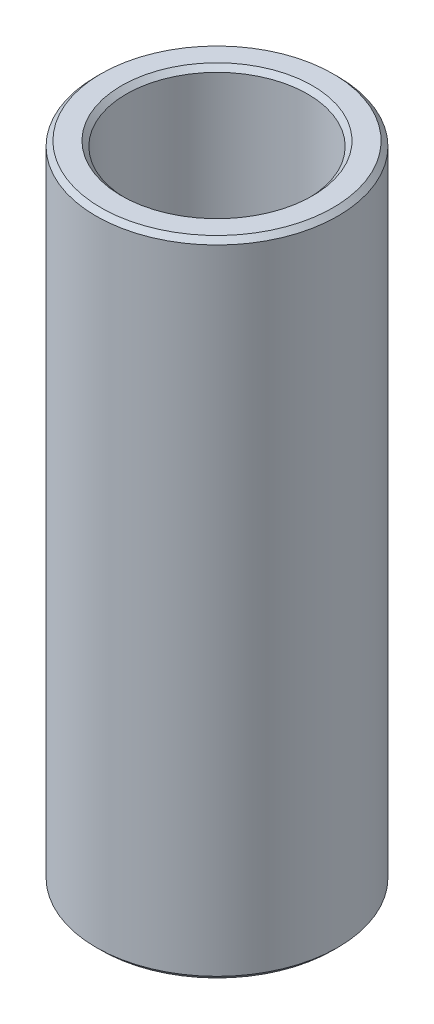
ISO-10303-21;
HEADER;
FILE_DESCRIPTION(('STEP AP214'),'2;1');
FILE_NAME('part.step','',(''),(''),'','','');
FILE_SCHEMA(('AUTOMOTIVE_DESIGN { 1 0 10303 214 1 1 1 1 }'));
ENDSEC;
DATA;
#1=APPLICATION_CONTEXT('core data for automotive mechanical design processes');
#2=APPLICATION_PROTOCOL_DEFINITION('international standard','automotive_design',2000,#1);
#3=PRODUCT_CONTEXT('',#1,'mechanical');
#4=PRODUCT('Part','Part','',(#3));
#5=PRODUCT_RELATED_PRODUCT_CATEGORY('part','',(#4));
#6=PRODUCT_DEFINITION_FORMATION('','',#4);
#7=PRODUCT_DEFINITION_CONTEXT('part definition',#1,'design');
#8=PRODUCT_DEFINITION('design','',#6,#7);
#9=PRODUCT_DEFINITION_SHAPE('','',#8);
#10=(LENGTH_UNIT() NAMED_UNIT(*) SI_UNIT(.MILLI.,.METRE.));
#11=(NAMED_UNIT(*) PLANE_ANGLE_UNIT() SI_UNIT($,.RADIAN.));
#12=(NAMED_UNIT(*) SI_UNIT($,.STERADIAN.) SOLID_ANGLE_UNIT());
#13=UNCERTAINTY_MEASURE_WITH_UNIT(LENGTH_MEASURE(1.E-05),#10,'distance_accuracy_value','');
#14=(GEOMETRIC_REPRESENTATION_CONTEXT(3) GLOBAL_UNCERTAINTY_ASSIGNED_CONTEXT((#13)) GLOBAL_UNIT_ASSIGNED_CONTEXT((#10,
#11,#12)) REPRESENTATION_CONTEXT('',''));
#15=CARTESIAN_POINT('',(0.,0.,0.));
#16=DIRECTION('',(0.,0.,1.));
#17=DIRECTION('',(1.,0.,0.));
#18=AXIS2_PLACEMENT_3D('',#15,#16,#17);
#19=CARTESIAN_POINT('',(6.35000000000028,131.762389929637,0.));
#20=DIRECTION('',(1.01331196386896E-11,-1.,0.));
#21=DIRECTION('',(1.,1.01331196386896E-11,0.));
#22=AXIS2_PLACEMENT_3D('',#19,#20,#21);
#23=PLANE('',#22);
#24=CARTESIAN_POINT('',(-9.65179645579483E-11,131.762389929573,0.));
#25=DIRECTION('',(1.01331196386896E-11,-1.,0.));
#26=DIRECTION('',(1.,1.01331196386896E-11,0.));
#27=AXIS2_PLACEMENT_3D('',#24,#25,#26);
#28=CIRCLE('',#27,5.01650000010457);
#29=CARTESIAN_POINT('',(5.01650000000805,131.762389929624,0.));
#30=VERTEX_POINT('',#29);
#31=EDGE_CURVE('E10',#30,#30,#28,.F.);
#32=ORIENTED_EDGE('',*,*,#31,.T.);
#33=EDGE_LOOP('',(#32));
#34=FACE_BOUND('',#33,.T.);
#35=CARTESIAN_POINT('',(-9.65179645579485E-11,131.762389929573,0.));
#36=DIRECTION('',(1.01331196386896E-11,-1.,0.));
#37=DIRECTION('',(1.,1.01331196386896E-11,0.));
#38=AXIS2_PLACEMENT_3D('',#35,#36,#37);
#39=CIRCLE('',#38,6.09600000010482);
#40=CARTESIAN_POINT('',(6.0960000000083,131.762389929634,0.));
#41=VERTEX_POINT('',#40);
#42=EDGE_CURVE('E38',#41,#41,#39,.T.);
#43=ORIENTED_EDGE('',*,*,#42,.T.);
#44=EDGE_LOOP('',(#43));
#45=FACE_BOUND('',#44,.T.);
#46=ADVANCED_FACE('F31',(#34,#45),#23,.T.);
#47=CARTESIAN_POINT('',(0.,122.237389929629,0.));
#48=DIRECTION('',(1.01331196386896E-11,-1.,0.));
#49=DIRECTION('',(1.,1.01331196386896E-11,0.));
#50=AXIS2_PLACEMENT_3D('',#47,#48,#49);
#51=CYLINDRICAL_SURFACE('',#50,4.76250000026766);
#52=CARTESIAN_POINT('',(-4.3620225437405E-10,165.284572823688,0.));
#53=DIRECTION('',(-1.01331196386897E-11,1.,0.));
#54=DIRECTION('',(-1.,-1.01331196386897E-11,0.));
#55=AXIS2_PLACEMENT_3D('',#52,#53,#54);
#56=CIRCLE('',#55,4.76250000026766);
#57=CARTESIAN_POINT('',(-4.76250000070386,165.284572823639,0.));
#58=VERTEX_POINT('',#57);
#59=EDGE_CURVE('E42',#58,#58,#56,.T.);
#60=ORIENTED_EDGE('',*,*,#59,.T.);
#61=EDGE_LOOP('',(#60));
#62=FACE_BOUND('',#61,.T.);
#63=CARTESIAN_POINT('',(-9.90917769445232E-11,132.01638992941,0.));
#64=DIRECTION('',(1.01331196386896E-11,-1.,0.));
#65=DIRECTION('',(1.,1.01331196386896E-11,0.));
#66=AXIS2_PLACEMENT_3D('',#63,#64,#65);
#67=CIRCLE('',#66,4.76250000026766);
#68=CARTESIAN_POINT('',(4.76250000016857,132.016389929458,0.));
#69=VERTEX_POINT('',#68);
#70=EDGE_CURVE('E46',#69,#69,#67,.T.);
#71=ORIENTED_EDGE('',*,*,#70,.T.);
#72=EDGE_LOOP('',(#71));
#73=FACE_BOUND('',#72,.T.);
#74=ADVANCED_FACE('F75',(#62,#73),#51,.F.);
#75=CARTESIAN_POINT('',(4.76250000000001,165.538572823899,0.));
#76=DIRECTION('',(-1.01331196386896E-11,1.,0.));
#77=DIRECTION('',(-1.,-1.01331196386896E-11,0.));
#78=AXIS2_PLACEMENT_3D('',#75,#76,#77);
#79=PLANE('',#78);
#80=CARTESIAN_POINT('',(-4.3877606676393E-10,165.538572823851,0.));
#81=DIRECTION('',(-1.01331196386896E-11,1.,0.));
#82=DIRECTION('',(-1.,-1.01331196386896E-11,0.));
#83=AXIS2_PLACEMENT_3D('',#80,#81,#82);
#84=CIRCLE('',#83,6.09600000043099);
#85=CARTESIAN_POINT('',(-6.09600000086977,165.538572823789,0.));
#86=VERTEX_POINT('',#85);
#87=EDGE_CURVE('E51',#86,#86,#84,.T.);
#88=ORIENTED_EDGE('',*,*,#87,.T.);
#89=EDGE_LOOP('',(#88));
#90=FACE_BOUND('',#89,.T.);
#91=CARTESIAN_POINT('',(-4.3877606676393E-10,165.538572823851,0.));
#92=DIRECTION('',(-1.01331196386896E-11,1.,0.));
#93=DIRECTION('',(-1.,-1.01331196386896E-11,0.));
#94=AXIS2_PLACEMENT_3D('',#91,#92,#93);
#95=CIRCLE('',#94,5.01650000043075);
#96=CARTESIAN_POINT('',(-5.01650000086953,165.5385728238,0.));
#97=VERTEX_POINT('',#96);
#98=EDGE_CURVE('E54',#97,#97,#95,.F.);
#99=ORIENTED_EDGE('',*,*,#98,.T.);
#100=EDGE_LOOP('',(#99));
#101=FACE_BOUND('',#100,.T.);
#102=ADVANCED_FACE('F80',(#90,#101),#79,.T.);
#103=CARTESIAN_POINT('',(0.,122.237389929629,0.));
#104=DIRECTION('',(1.01331196386896E-11,-1.,0.));
#105=DIRECTION('',(1.,1.01331196386896E-11,0.));
#106=AXIS2_PLACEMENT_3D('',#103,#104,#105);
#107=CYLINDRICAL_SURFACE('',#106,6.35000000026793);
#108=CARTESIAN_POINT('',(-4.36202254377355E-10,165.284572824014,0.));
#109=DIRECTION('',(-1.01331196386896E-11,1.,0.));
#110=DIRECTION('',(-1.,-1.01331196386896E-11,0.));
#111=AXIS2_PLACEMENT_3D('',#108,#109,#110);
#112=CIRCLE('',#111,6.35000000026793);
#113=CARTESIAN_POINT('',(-6.35000000070413,165.284572823949,0.));
#114=VERTEX_POINT('',#113);
#115=EDGE_CURVE('E57',#114,#114,#112,.F.);
#116=ORIENTED_EDGE('',*,*,#115,.T.);
#117=EDGE_LOOP('',(#116));
#118=FACE_BOUND('',#117,.T.);
#119=CARTESIAN_POINT('',(-9.90917769478286E-11,132.016389929736,0.));
#120=DIRECTION('',(1.01331196386896E-11,-1.,0.));
#121=DIRECTION('',(1.,1.01331196386896E-11,0.));
#122=AXIS2_PLACEMENT_3D('',#119,#120,#121);
#123=CIRCLE('',#122,6.35000000026793);
#124=CARTESIAN_POINT('',(6.35000000016883,132.0163899298,0.));
#125=VERTEX_POINT('',#124);
#126=EDGE_CURVE('E60',#125,#125,#123,.F.);
#127=ORIENTED_EDGE('',*,*,#126,.T.);
#128=EDGE_LOOP('',(#127));
#129=FACE_BOUND('',#128,.T.);
#130=ADVANCED_FACE('F64',(#118,#129),#107,.T.);
#131=CARTESIAN_POINT('',(-4.36202254377355E-10,165.284572824014,0.));
#132=DIRECTION('',(1.01331196386896E-11,-1.,0.));
#133=DIRECTION('',(1.,1.01331196386896E-11,0.));
#134=AXIS2_PLACEMENT_3D('',#131,#132,#133);
#135=CONICAL_SURFACE('',#134,6.35000000026793,0.78539816339747);
#136=ORIENTED_EDGE('',*,*,#87,.F.);
#137=EDGE_LOOP('',(#136));
#138=FACE_BOUND('',#137,.T.);
#139=ORIENTED_EDGE('',*,*,#115,.F.);
#140=EDGE_LOOP('',(#139));
#141=FACE_BOUND('',#140,.T.);
#142=ADVANCED_FACE('F85',(#138,#141),#135,.T.);
#143=CARTESIAN_POINT('',(-4.3877606676393E-10,165.538572823851,0.));
#144=DIRECTION('',(-1.01331196386897E-11,1.,0.));
#145=DIRECTION('',(-1.,-1.01331196386897E-11,0.));
#146=AXIS2_PLACEMENT_3D('',#143,#144,#145);
#147=CONICAL_SURFACE('',#146,5.01650000043074,0.785398163397424);
#148=ORIENTED_EDGE('',*,*,#59,.F.);
#149=EDGE_LOOP('',(#148));
#150=FACE_BOUND('',#149,.T.);
#151=ORIENTED_EDGE('',*,*,#98,.F.);
#152=EDGE_LOOP('',(#151));
#153=FACE_BOUND('',#152,.T.);
#154=ADVANCED_FACE('F72',(#150,#153),#147,.F.);
#155=CARTESIAN_POINT('',(-9.9091776944523E-11,132.01638992941,0.));
#156=DIRECTION('',(1.01331196386896E-11,-1.,0.));
#157=DIRECTION('',(1.,1.01331196386896E-11,0.));
#158=AXIS2_PLACEMENT_3D('',#155,#156,#157);
#159=CONICAL_SURFACE('',#158,4.76250000026766,0.785398163397424);
#160=ORIENTED_EDGE('',*,*,#31,.F.);
#161=EDGE_LOOP('',(#160));
#162=FACE_BOUND('',#161,.T.);
#163=ORIENTED_EDGE('',*,*,#70,.F.);
#164=EDGE_LOOP('',(#163));
#165=FACE_BOUND('',#164,.T.);
#166=ADVANCED_FACE('F68',(#162,#165),#159,.F.);
#167=CARTESIAN_POINT('',(-9.65179645579485E-11,131.762389929573,0.));
#168=DIRECTION('',(-1.01331196386896E-11,1.,0.));
#169=DIRECTION('',(-1.,-1.01331196386896E-11,0.));
#170=AXIS2_PLACEMENT_3D('',#167,#168,#169);
#171=CONICAL_SURFACE('',#170,6.09600000010483,0.785398163397399);
#172=ORIENTED_EDGE('',*,*,#126,.F.);
#173=EDGE_LOOP('',(#172));
#174=FACE_BOUND('',#173,.T.);
#175=ORIENTED_EDGE('',*,*,#42,.F.);
#176=EDGE_LOOP('',(#175));
#177=FACE_BOUND('',#176,.T.);
#178=ADVANCED_FACE('F33',(#174,#177),#171,.T.);
#179=CLOSED_SHELL('',(#46,#74,#102,#130,#142,#154,#166,#178));
#180=MANIFOLD_SOLID_BREP('B2',#179);
#181=ADVANCED_BREP_SHAPE_REPRESENTATION('',(#18,#180),#14);
#182=SHAPE_DEFINITION_REPRESENTATION(#9,#181);
ENDSEC;
END-ISO-10303-21;
